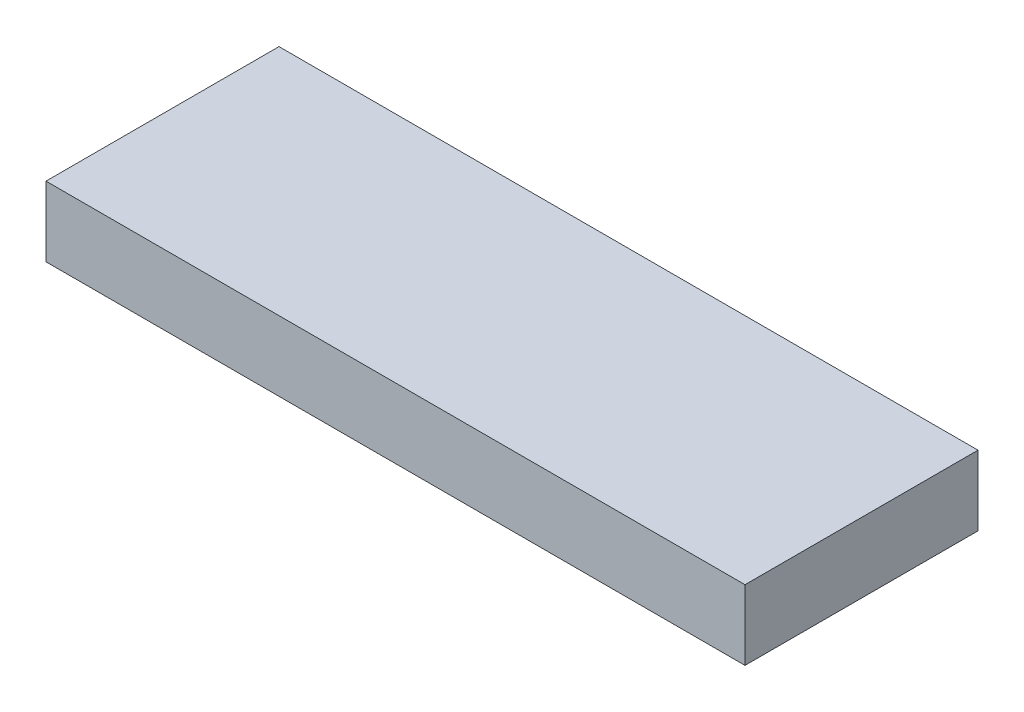
ISO-10303-21;
HEADER;
FILE_DESCRIPTION(('STEP AP214'),'2;1');
FILE_NAME('part.step','',(''),(''),'','','');
FILE_SCHEMA(('AUTOMOTIVE_DESIGN { 1 0 10303 214 1 1 1 1 }'));
ENDSEC;
DATA;
#1=APPLICATION_CONTEXT('core data for automotive mechanical design processes');
#2=APPLICATION_PROTOCOL_DEFINITION('international standard','automotive_design',2000,#1);
#3=PRODUCT_CONTEXT('',#1,'mechanical');
#4=PRODUCT('Part','Part','',(#3));
#5=PRODUCT_RELATED_PRODUCT_CATEGORY('part','',(#4));
#6=PRODUCT_DEFINITION_FORMATION('','',#4);
#7=PRODUCT_DEFINITION_CONTEXT('part definition',#1,'design');
#8=PRODUCT_DEFINITION('design','',#6,#7);
#9=PRODUCT_DEFINITION_SHAPE('','',#8);
#10=(LENGTH_UNIT() NAMED_UNIT(*) SI_UNIT(.MILLI.,.METRE.));
#11=(NAMED_UNIT(*) PLANE_ANGLE_UNIT() SI_UNIT($,.RADIAN.));
#12=(NAMED_UNIT(*) SI_UNIT($,.STERADIAN.) SOLID_ANGLE_UNIT());
#13=UNCERTAINTY_MEASURE_WITH_UNIT(LENGTH_MEASURE(1.E-05),#10,'distance_accuracy_value','');
#14=(GEOMETRIC_REPRESENTATION_CONTEXT(3) GLOBAL_UNCERTAINTY_ASSIGNED_CONTEXT((#13)) GLOBAL_UNIT_ASSIGNED_CONTEXT((#10,
#11,#12)) REPRESENTATION_CONTEXT('',''));
#15=CARTESIAN_POINT('',(0.,0.,0.));
#16=DIRECTION('',(0.,0.,1.));
#17=DIRECTION('',(1.,0.,0.));
#18=AXIS2_PLACEMENT_3D('',#15,#16,#17);
#19=CARTESIAN_POINT('',(300.,-50.01,13.));
#20=DIRECTION('',(0.,0.,-1.));
#21=DIRECTION('',(-1.,0.,0.));
#22=AXIS2_PLACEMENT_3D('',#19,#20,#21);
#23=PLANE('',#22);
#24=DIRECTION('',(0.,-1.,0.));
#25=VECTOR('',#24,1.);
#26=CARTESIAN_POINT('',(300.,1.71683972880179E-13,13.));
#27=LINE('',#26,#25);
#28=CARTESIAN_POINT('',(300.,-47.,13.));
#29=VERTEX_POINT('',#28);
#30=CARTESIAN_POINT('',(300.,-50.,13.));
#31=VERTEX_POINT('',#30);
#32=EDGE_CURVE('E94',#29,#31,#27,.T.);
#33=ORIENTED_EDGE('',*,*,#32,.T.);
#34=DIRECTION('',(-1.,0.,0.));
#35=VECTOR('',#34,1.);
#36=CARTESIAN_POINT('',(-300.,-50.,13.));
#37=LINE('',#36,#35);
#38=CARTESIAN_POINT('',(270.,-50.,13.));
#39=VERTEX_POINT('',#38);
#40=EDGE_CURVE('E79',#31,#39,#37,.T.);
#41=ORIENTED_EDGE('',*,*,#40,.T.);
#42=DIRECTION('',(0.,1.,0.));
#43=VECTOR('',#42,1.);
#44=CARTESIAN_POINT('',(270.,-50.01,13.));
#45=LINE('',#44,#43);
#46=CARTESIAN_POINT('',(270.,-47.,13.));
#47=VERTEX_POINT('',#46);
#48=EDGE_CURVE('E43',#39,#47,#45,.T.);
#49=ORIENTED_EDGE('',*,*,#48,.T.);
#50=DIRECTION('',(1.,0.,0.));
#51=VECTOR('',#50,1.);
#52=CARTESIAN_POINT('',(-300.,-47.,13.));
#53=LINE('',#52,#51);
#54=EDGE_CURVE('E91',#47,#29,#53,.T.);
#55=ORIENTED_EDGE('',*,*,#54,.T.);
#56=EDGE_LOOP('',(#33,#41,#49,#55));
#57=FACE_BOUND('',#56,.T.);
#58=ADVANCED_FACE('F35',(#57),#23,.T.);
#59=CARTESIAN_POINT('',(300.,-50.01,23.));
#60=DIRECTION('',(0.,0.,1.));
#61=DIRECTION('',(1.,0.,0.));
#62=AXIS2_PLACEMENT_3D('',#59,#60,#61);
#63=PLANE('',#62);
#64=DIRECTION('',(0.,1.,0.));
#65=VECTOR('',#64,1.);
#66=CARTESIAN_POINT('',(270.,-50.01,23.));
#67=LINE('',#66,#65);
#68=CARTESIAN_POINT('',(270.,-50.,23.));
#69=VERTEX_POINT('',#68);
#70=CARTESIAN_POINT('',(270.,-47.,23.));
#71=VERTEX_POINT('',#70);
#72=EDGE_CURVE('E11',#69,#71,#67,.T.);
#73=ORIENTED_EDGE('',*,*,#72,.F.);
#74=DIRECTION('',(1.,0.,0.));
#75=VECTOR('',#74,1.);
#76=CARTESIAN_POINT('',(-300.,-50.,23.));
#77=LINE('',#76,#75);
#78=CARTESIAN_POINT('',(300.,-50.,23.));
#79=VERTEX_POINT('',#78);
#80=EDGE_CURVE('E78',#69,#79,#77,.T.);
#81=ORIENTED_EDGE('',*,*,#80,.T.);
#82=DIRECTION('',(0.,1.,0.));
#83=VECTOR('',#82,1.);
#84=CARTESIAN_POINT('',(300.,1.71683972880179E-13,23.));
#85=LINE('',#84,#83);
#86=CARTESIAN_POINT('',(300.,-47.,23.));
#87=VERTEX_POINT('',#86);
#88=EDGE_CURVE('E89',#79,#87,#85,.T.);
#89=ORIENTED_EDGE('',*,*,#88,.T.);
#90=DIRECTION('',(-1.,0.,0.));
#91=VECTOR('',#90,1.);
#92=CARTESIAN_POINT('',(-300.,-47.,23.));
#93=LINE('',#92,#91);
#94=EDGE_CURVE('E96',#87,#71,#93,.T.);
#95=ORIENTED_EDGE('',*,*,#94,.T.);
#96=EDGE_LOOP('',(#73,#81,#89,#95));
#97=FACE_BOUND('',#96,.T.);
#98=ADVANCED_FACE('F88',(#97),#63,.T.);
#99=CARTESIAN_POINT('',(270.,-50.01,13.));
#100=DIRECTION('',(-1.,0.,0.));
#101=DIRECTION('',(0.,0.,1.));
#102=AXIS2_PLACEMENT_3D('',#99,#100,#101);
#103=PLANE('',#102);
#104=ORIENTED_EDGE('',*,*,#48,.F.);
#105=DIRECTION('',(0.,0.,1.));
#106=VECTOR('',#105,1.);
#107=CARTESIAN_POINT('',(270.,-50.,60.));
#108=LINE('',#107,#106);
#109=EDGE_CURVE('E90',#39,#69,#108,.T.);
#110=ORIENTED_EDGE('',*,*,#109,.T.);
#111=ORIENTED_EDGE('',*,*,#72,.T.);
#112=DIRECTION('',(0.,0.,-1.));
#113=VECTOR('',#112,1.);
#114=CARTESIAN_POINT('',(270.,-47.,3.));
#115=LINE('',#114,#113);
#116=EDGE_CURVE('E101',#71,#47,#115,.T.);
#117=ORIENTED_EDGE('',*,*,#116,.T.);
#118=EDGE_LOOP('',(#104,#110,#111,#117));
#119=FACE_BOUND('',#118,.T.);
#120=ADVANCED_FACE('F109',(#119),#103,.T.);
#121=CARTESIAN_POINT('',(300.,1.71683972880179E-13,0.));
#122=DIRECTION('',(-1.,0.,0.));
#123=DIRECTION('',(0.,-1.,0.));
#124=AXIS2_PLACEMENT_3D('',#121,#122,#123);
#125=PLANE('',#124);
#126=ORIENTED_EDGE('',*,*,#32,.F.);
#127=DIRECTION('',(0.,0.,1.));
#128=VECTOR('',#127,1.);
#129=CARTESIAN_POINT('',(300.,-47.,3.));
#130=LINE('',#129,#128);
#131=EDGE_CURVE('E84',#29,#87,#130,.T.);
#132=ORIENTED_EDGE('',*,*,#131,.T.);
#133=ORIENTED_EDGE('',*,*,#88,.F.);
#134=DIRECTION('',(0.,0.,-1.));
#135=VECTOR('',#134,1.);
#136=CARTESIAN_POINT('',(300.,-50.,60.));
#137=LINE('',#136,#135);
#138=EDGE_CURVE('E74',#79,#31,#137,.T.);
#139=ORIENTED_EDGE('',*,*,#138,.T.);
#140=EDGE_LOOP('',(#126,#132,#133,#139));
#141=FACE_BOUND('',#140,.T.);
#142=ADVANCED_FACE('F37',(#141),#125,.F.);
#143=CARTESIAN_POINT('',(-300.,-47.,3.));
#144=DIRECTION('',(0.,-1.,0.));
#145=DIRECTION('',(0.,0.,-1.));
#146=AXIS2_PLACEMENT_3D('',#143,#144,#145);
#147=PLANE('',#146);
#148=ORIENTED_EDGE('',*,*,#54,.F.);
#149=ORIENTED_EDGE('',*,*,#116,.F.);
#150=ORIENTED_EDGE('',*,*,#94,.F.);
#151=ORIENTED_EDGE('',*,*,#131,.F.);
#152=EDGE_LOOP('',(#148,#149,#150,#151));
#153=FACE_BOUND('',#152,.T.);
#154=ADVANCED_FACE('F108',(#153),#147,.F.);
#155=CARTESIAN_POINT('',(-300.,-50.,60.));
#156=DIRECTION('',(0.,1.,0.));
#157=DIRECTION('',(0.,0.,1.));
#158=AXIS2_PLACEMENT_3D('',#155,#156,#157);
#159=PLANE('',#158);
#160=ORIENTED_EDGE('',*,*,#40,.F.);
#161=ORIENTED_EDGE('',*,*,#138,.F.);
#162=ORIENTED_EDGE('',*,*,#80,.F.);
#163=ORIENTED_EDGE('',*,*,#109,.F.);
#164=EDGE_LOOP('',(#160,#161,#162,#163));
#165=FACE_BOUND('',#164,.T.);
#166=ADVANCED_FACE('F76',(#165),#159,.F.);
#167=CLOSED_SHELL('',(#58,#98,#120,#142,#154,#166));
#168=MANIFOLD_SOLID_BREP('B2',#167);
#169=ADVANCED_BREP_SHAPE_REPRESENTATION('',(#18,#168),#14);
#170=SHAPE_DEFINITION_REPRESENTATION(#9,#169);
ENDSEC;
END-ISO-10303-21;
